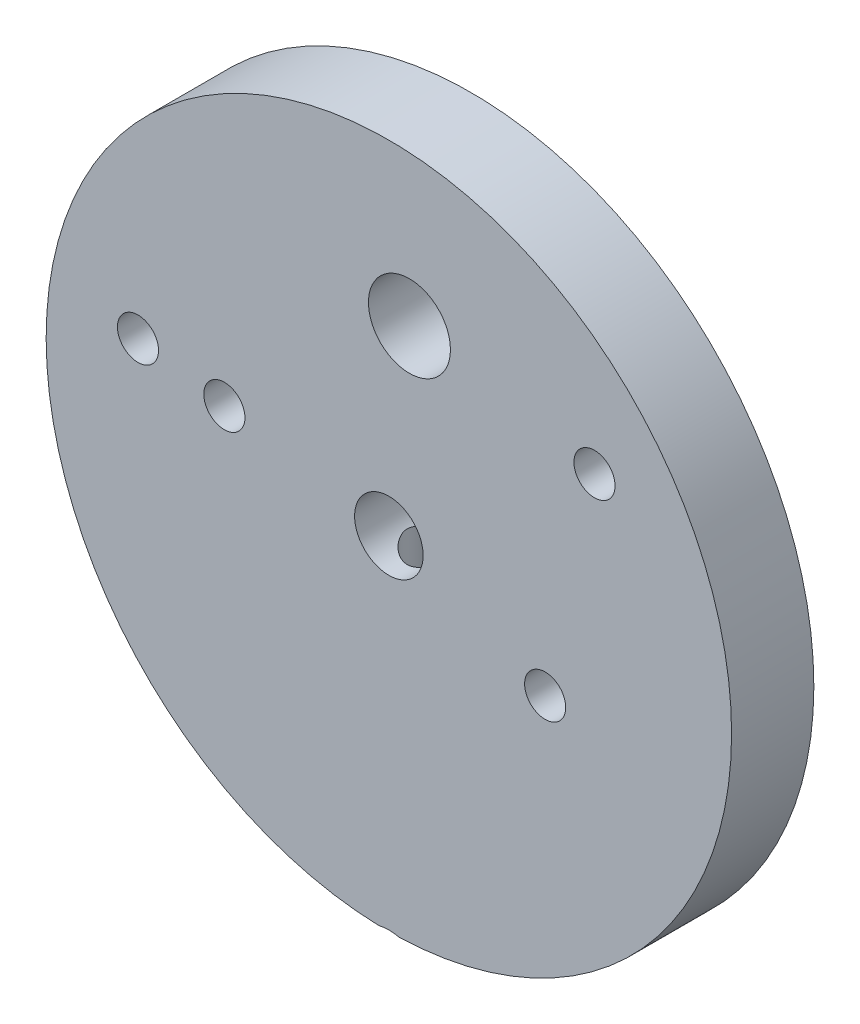
ISO-10303-21;
HEADER;
FILE_DESCRIPTION(('STEP AP214'),'2;1');
FILE_NAME('part.step','',(''),(''),'','','');
FILE_SCHEMA(('AUTOMOTIVE_DESIGN { 1 0 10303 214 1 1 1 1 }'));
ENDSEC;
DATA;
#1=APPLICATION_CONTEXT('core data for automotive mechanical design processes');
#2=APPLICATION_PROTOCOL_DEFINITION('international standard','automotive_design',2000,#1);
#3=PRODUCT_CONTEXT('',#1,'mechanical');
#4=PRODUCT('Part','Part','',(#3));
#5=PRODUCT_RELATED_PRODUCT_CATEGORY('part','',(#4));
#6=PRODUCT_DEFINITION_FORMATION('','',#4);
#7=PRODUCT_DEFINITION_CONTEXT('part definition',#1,'design');
#8=PRODUCT_DEFINITION('design','',#6,#7);
#9=PRODUCT_DEFINITION_SHAPE('','',#8);
#10=(LENGTH_UNIT() NAMED_UNIT(*) SI_UNIT(.MILLI.,.METRE.));
#11=(NAMED_UNIT(*) PLANE_ANGLE_UNIT() SI_UNIT($,.RADIAN.));
#12=(NAMED_UNIT(*) SI_UNIT($,.STERADIAN.) SOLID_ANGLE_UNIT());
#13=UNCERTAINTY_MEASURE_WITH_UNIT(LENGTH_MEASURE(1.E-05),#10,'distance_accuracy_value','');
#14=(GEOMETRIC_REPRESENTATION_CONTEXT(3) GLOBAL_UNCERTAINTY_ASSIGNED_CONTEXT((#13)) GLOBAL_UNIT_ASSIGNED_CONTEXT((#10,
#11,#12)) REPRESENTATION_CONTEXT('',''));
#15=CARTESIAN_POINT('',(0.,0.,0.));
#16=DIRECTION('',(0.,0.,1.));
#17=DIRECTION('',(1.,0.,0.));
#18=AXIS2_PLACEMENT_3D('',#15,#16,#17);
#19=CARTESIAN_POINT('',(0.,0.,3.));
#20=DIRECTION('',(0.,0.,1.));
#21=DIRECTION('',(1.,0.,0.));
#22=AXIS2_PLACEMENT_3D('',#19,#20,#21);
#23=PLANE('',#22);
#24=CARTESIAN_POINT('',(-2.83664534621359,-26.0287476091661,3.));
#25=CARTESIAN_POINT('',(-2.76531072517493,-25.979747647708,3.));
#26=CARTESIAN_POINT('',(-2.6935251877055,-25.9313937572425,3.));
#27=CARTESIAN_POINT('',(-2.54890587795035,-25.8362334592615,3.));
#28=CARTESIAN_POINT('',(-2.47607179603977,-25.7894275228763,3.));
#29=CARTESIAN_POINT('',(-2.32872818174244,-25.6973209891236,3.));
#30=CARTESIAN_POINT('',(-2.25421040362229,-25.6520335125885,3.));
#31=CARTESIAN_POINT('',(-2.10387584627041,-25.5636873397159,3.));
#32=CARTESIAN_POINT('',(-2.02805917154243,-25.5206284651849,3.));
#33=CARTESIAN_POINT('',(-1.79346473550118,-25.3926890623925,3.));
#34=CARTESIAN_POINT('',(-1.63229987426929,-25.312089953461,3.));
#35=CARTESIAN_POINT('',(-1.30302104487734,-25.1674390749372,3.));
#36=CARTESIAN_POINT('',(-1.13493074142441,-25.1033356270002,3.));
#37=CARTESIAN_POINT('',(-0.888434419115741,-25.0279764703033,3.));
#38=CARTESIAN_POINT('',(-0.8128906352692,-25.0073008818853,3.));
#39=CARTESIAN_POINT('',(-0.660576482159613,-24.9709760094303,3.));
#40=CARTESIAN_POINT('',(-0.583805949312308,-24.9553274017014,3.));
#41=CARTESIAN_POINT('',(-0.430179544278816,-24.929749902811,3.));
#42=CARTESIAN_POINT('',(-0.353333964597223,-24.9197597930517,3.));
#43=CARTESIAN_POINT('',(-0.199107895655327,-24.9056191999211,3.));
#44=CARTESIAN_POINT('',(-0.121727433519484,-24.9014684225826,3.));
#45=CARTESIAN_POINT('',(0.0484399656678558,-24.8989599826423,3.));
#46=CARTESIAN_POINT('',(0.141249236879402,-24.9019094067401,3.));
#47=CARTESIAN_POINT('',(0.326212401348018,-24.9162730746567,3.));
#48=CARTESIAN_POINT('',(0.418366158053664,-24.9276890328668,3.));
#49=CARTESIAN_POINT('',(0.602608166973431,-24.9585566782451,3.));
#50=CARTESIAN_POINT('',(0.694678002494478,-24.9781169747769,3.));
#51=CARTESIAN_POINT('',(0.876977203352027,-25.0243099762964,3.));
#52=CARTESIAN_POINT('',(0.967206813915699,-25.050941732227,3.));
#53=CARTESIAN_POINT('',(1.24673620285726,-25.1437740909094,3.));
#54=CARTESIAN_POINT('',(1.43252000344217,-25.2206319752431,3.));
#55=CARTESIAN_POINT('',(1.7047064715636,-25.3495840799246,3.));
#56=CARTESIAN_POINT('',(1.79451611571029,-25.3949436771718,3.));
#57=CARTESIAN_POINT('',(1.97215660266382,-25.4893928032348,3.));
#58=CARTESIAN_POINT('',(2.05998776589235,-25.5384817223611,3.));
#59=CARTESIAN_POINT('',(2.23039384174165,-25.6376531878738,3.));
#60=CARTESIAN_POINT('',(2.31303842428243,-25.6876173073952,3.));
#61=CARTESIAN_POINT('',(2.47689739966926,-25.7898487587656,3.));
#62=CARTESIAN_POINT('',(2.55811168003427,-25.8421162706346,3.));
#63=CARTESIAN_POINT('',(2.71865064586211,-25.9481415803404,3.));
#64=CARTESIAN_POINT('',(2.79798511486534,-26.0018846264753,3.));
#65=CARTESIAN_POINT('',(2.95553686167846,-26.1109377048038,3.));
#66=CARTESIAN_POINT('',(3.03375445763521,-26.166247276808,3.));
#67=CARTESIAN_POINT('',(3.11149968366827,-26.2222020176604,3.));
#68=B_SPLINE_CURVE_WITH_KNOTS('',3,(#24,#25,#26,#27,#28,#29,#30,#31,#32,#33,#34,#35,#36,#37,#38,
#39,#40,#41,#42,#43,#44,#45,#46,#47,#48,#49,#50,#51,#52,#53,#54,#55,#56,#57,#58,#59,#60,#61,#62,
#63,#64,#65,#66,#67),.UNSPECIFIED.,.F.,.F.,(4,2,2,2,2,2,2,2,2,2,2,2,2,2,2,2,2,2,2,2,2,4),(0.,
0.25963260985944,0.519343526732954,0.780907174044351,1.0424498749647,1.58244656220319,
2.12073034159699,2.35555508627146,2.59041141003198,2.82267578505833,3.05492846687895,
3.33308355702868,3.61129498627928,3.8933417824535,4.17535074437951,4.77670376445668,
5.07851488682883,5.38027677323758,5.66995963159193,5.95966517020511,6.24711760365554,
6.53448645222936),.UNSPECIFIED.);
#69=CARTESIAN_POINT('',(0.736747252931383,-24.9891417116574,3.));
#70=VERTEX_POINT('',#69);
#71=CARTESIAN_POINT('',(-0.736747252931388,-24.9891417116574,3.));
#72=VERTEX_POINT('',#71);
#73=EDGE_CURVE('E54',#70,#72,#68,.F.);
#74=ORIENTED_EDGE('',*,*,#73,.F.);
#75=CARTESIAN_POINT('',(0.,0.,3.));
#76=DIRECTION('',(0.,0.,1.));
#77=DIRECTION('',(1.,0.,0.));
#78=AXIS2_PLACEMENT_3D('',#75,#76,#77);
#79=CIRCLE('',#78,25.);
#80=EDGE_CURVE('E68',#70,#72,#79,.T.);
#81=ORIENTED_EDGE('',*,*,#80,.T.);
#82=EDGE_LOOP('',(#74,#81));
#83=FACE_BOUND('',#82,.T.);
#84=CARTESIAN_POINT('',(15.,11.4,3.));
#85=DIRECTION('',(0.,0.,1.));
#86=DIRECTION('',(1.,0.,0.));
#87=AXIS2_PLACEMENT_3D('',#84,#85,#86);
#88=CIRCLE('',#87,1.5);
#89=CARTESIAN_POINT('',(16.5,11.4,3.));
#90=VERTEX_POINT('',#89);
#91=EDGE_CURVE('E124',#90,#90,#88,.T.);
#92=ORIENTED_EDGE('',*,*,#91,.F.);
#93=EDGE_LOOP('',(#92));
#94=FACE_BOUND('',#93,.T.);
#95=CARTESIAN_POINT('',(1.5,14.,3.));
#96=DIRECTION('',(0.,0.,1.));
#97=DIRECTION('',(1.,0.,0.));
#98=AXIS2_PLACEMENT_3D('',#95,#96,#97);
#99=CIRCLE('',#98,2.99);
#100=CARTESIAN_POINT('',(4.49,14.,3.));
#101=VERTEX_POINT('',#100);
#102=EDGE_CURVE('E128',#101,#101,#99,.T.);
#103=ORIENTED_EDGE('',*,*,#102,.F.);
#104=EDGE_LOOP('',(#103));
#105=FACE_BOUND('',#104,.T.);
#106=CARTESIAN_POINT('',(-18.3,3.3,3.));
#107=DIRECTION('',(0.,0.,1.));
#108=DIRECTION('',(1.,0.,0.));
#109=AXIS2_PLACEMENT_3D('',#106,#107,#108);
#110=CIRCLE('',#109,1.5);
#111=CARTESIAN_POINT('',(-16.8,3.3,3.));
#112=VERTEX_POINT('',#111);
#113=EDGE_CURVE('E76',#112,#112,#110,.T.);
#114=ORIENTED_EDGE('',*,*,#113,.F.);
#115=EDGE_LOOP('',(#114));
#116=FACE_BOUND('',#115,.T.);
#117=CARTESIAN_POINT('',(-12.,2.2,3.));
#118=DIRECTION('',(0.,0.,1.));
#119=DIRECTION('',(1.,0.,0.));
#120=AXIS2_PLACEMENT_3D('',#117,#118,#119);
#121=CIRCLE('',#120,1.5);
#122=CARTESIAN_POINT('',(-10.5,2.2,3.));
#123=VERTEX_POINT('',#122);
#124=EDGE_CURVE('E134',#123,#123,#121,.T.);
#125=ORIENTED_EDGE('',*,*,#124,.F.);
#126=EDGE_LOOP('',(#125));
#127=FACE_BOUND('',#126,.T.);
#128=CARTESIAN_POINT('',(0.,0.,3.));
#129=DIRECTION('',(0.,0.,1.));
#130=DIRECTION('',(1.,0.,0.));
#131=AXIS2_PLACEMENT_3D('',#128,#129,#130);
#132=CIRCLE('',#131,2.5);
#133=CARTESIAN_POINT('',(2.5,0.,3.));
#134=VERTEX_POINT('',#133);
#135=EDGE_CURVE('E138',#134,#134,#132,.T.);
#136=ORIENTED_EDGE('',*,*,#135,.F.);
#137=EDGE_LOOP('',(#136));
#138=FACE_BOUND('',#137,.T.);
#139=CARTESIAN_POINT('',(11.4,-4.4,3.));
#140=DIRECTION('',(0.,0.,1.));
#141=DIRECTION('',(1.,0.,0.));
#142=AXIS2_PLACEMENT_3D('',#139,#140,#141);
#143=CIRCLE('',#142,1.5);
#144=CARTESIAN_POINT('',(12.9,-4.4,3.));
#145=VERTEX_POINT('',#144);
#146=EDGE_CURVE('E141',#145,#145,#143,.T.);
#147=ORIENTED_EDGE('',*,*,#146,.F.);
#148=EDGE_LOOP('',(#147));
#149=FACE_BOUND('',#148,.T.);
#150=ADVANCED_FACE('F33',(#83,#94,#105,#116,#127,#138,#149),#23,.T.);
#151=CARTESIAN_POINT('',(0.,0.,-3.));
#152=DIRECTION('',(0.,0.,1.));
#153=DIRECTION('',(1.,0.,0.));
#154=AXIS2_PLACEMENT_3D('',#151,#152,#153);
#155=PLANE('',#154);
#156=CARTESIAN_POINT('',(15.,11.4,-3.));
#157=DIRECTION('',(0.,0.,1.));
#158=DIRECTION('',(1.,0.,0.));
#159=AXIS2_PLACEMENT_3D('',#156,#157,#158);
#160=CIRCLE('',#159,1.5);
#161=CARTESIAN_POINT('',(16.5,11.4,-3.));
#162=VERTEX_POINT('',#161);
#163=EDGE_CURVE('E143',#162,#162,#160,.T.);
#164=ORIENTED_EDGE('',*,*,#163,.T.);
#165=EDGE_LOOP('',(#164));
#166=FACE_BOUND('',#165,.T.);
#167=CARTESIAN_POINT('',(1.5,14.,-3.));
#168=DIRECTION('',(0.,0.,1.));
#169=DIRECTION('',(1.,0.,0.));
#170=AXIS2_PLACEMENT_3D('',#167,#168,#169);
#171=CIRCLE('',#170,2.99);
#172=CARTESIAN_POINT('',(4.49,14.,-3.));
#173=VERTEX_POINT('',#172);
#174=EDGE_CURVE('E155',#173,#173,#171,.T.);
#175=ORIENTED_EDGE('',*,*,#174,.T.);
#176=EDGE_LOOP('',(#175));
#177=FACE_BOUND('',#176,.T.);
#178=CARTESIAN_POINT('',(-18.3,3.3,-3.));
#179=DIRECTION('',(0.,0.,1.));
#180=DIRECTION('',(1.,0.,0.));
#181=AXIS2_PLACEMENT_3D('',#178,#179,#180);
#182=CIRCLE('',#181,1.5);
#183=CARTESIAN_POINT('',(-16.8,3.3,-3.));
#184=VERTEX_POINT('',#183);
#185=EDGE_CURVE('E80',#184,#184,#182,.T.);
#186=ORIENTED_EDGE('',*,*,#185,.T.);
#187=EDGE_LOOP('',(#186));
#188=FACE_BOUND('',#187,.T.);
#189=CARTESIAN_POINT('',(0.,0.,-3.));
#190=DIRECTION('',(0.,0.,1.));
#191=DIRECTION('',(1.,0.,0.));
#192=AXIS2_PLACEMENT_3D('',#189,#190,#191);
#193=CIRCLE('',#192,25.);
#194=CARTESIAN_POINT('',(0.736747252931383,-24.9891417116574,-3.));
#195=VERTEX_POINT('',#194);
#196=CARTESIAN_POINT('',(-0.736747252931388,-24.9891417116574,-3.));
#197=VERTEX_POINT('',#196);
#198=EDGE_CURVE('E73',#195,#197,#193,.T.);
#199=ORIENTED_EDGE('',*,*,#198,.F.);
#200=CARTESIAN_POINT('',(-2.83664534621359,-26.0287476091661,-3.));
#201=CARTESIAN_POINT('',(-2.76531072517493,-25.979747647708,-3.));
#202=CARTESIAN_POINT('',(-2.6935251877055,-25.9313937572425,-3.));
#203=CARTESIAN_POINT('',(-2.54890587795035,-25.8362334592615,-3.));
#204=CARTESIAN_POINT('',(-2.47607179603977,-25.7894275228763,-3.));
#205=CARTESIAN_POINT('',(-2.32872818174244,-25.6973209891236,-3.));
#206=CARTESIAN_POINT('',(-2.25421040362229,-25.6520335125885,-3.));
#207=CARTESIAN_POINT('',(-2.10387584627041,-25.5636873397159,-3.));
#208=CARTESIAN_POINT('',(-2.02805917154243,-25.5206284651849,-3.));
#209=CARTESIAN_POINT('',(-1.79346473550118,-25.3926890623925,-3.));
#210=CARTESIAN_POINT('',(-1.63229987426929,-25.312089953461,-3.));
#211=CARTESIAN_POINT('',(-1.30302104487734,-25.1674390749372,-3.));
#212=CARTESIAN_POINT('',(-1.13493074142441,-25.1033356270002,-3.));
#213=CARTESIAN_POINT('',(-0.888434419115741,-25.0279764703033,-3.));
#214=CARTESIAN_POINT('',(-0.8128906352692,-25.0073008818853,-3.));
#215=CARTESIAN_POINT('',(-0.660576482159613,-24.9709760094303,-3.));
#216=CARTESIAN_POINT('',(-0.583805949312308,-24.9553274017014,-3.));
#217=CARTESIAN_POINT('',(-0.430179544278816,-24.929749902811,-3.));
#218=CARTESIAN_POINT('',(-0.353333964597223,-24.9197597930517,-3.));
#219=CARTESIAN_POINT('',(-0.199107895655327,-24.9056191999211,-3.));
#220=CARTESIAN_POINT('',(-0.121727433519484,-24.9014684225826,-3.));
#221=CARTESIAN_POINT('',(0.0484399656678558,-24.8989599826423,-3.));
#222=CARTESIAN_POINT('',(0.141249236879402,-24.9019094067401,-3.));
#223=CARTESIAN_POINT('',(0.326212401348018,-24.9162730746567,-3.));
#224=CARTESIAN_POINT('',(0.418366158053664,-24.9276890328668,-3.));
#225=CARTESIAN_POINT('',(0.602608166973431,-24.9585566782451,-3.));
#226=CARTESIAN_POINT('',(0.694678002494478,-24.9781169747769,-3.));
#227=CARTESIAN_POINT('',(0.876977203352027,-25.0243099762964,-3.));
#228=CARTESIAN_POINT('',(0.967206813915699,-25.050941732227,-3.));
#229=CARTESIAN_POINT('',(1.24673620285726,-25.1437740909094,-3.));
#230=CARTESIAN_POINT('',(1.43252000344217,-25.2206319752431,-3.));
#231=CARTESIAN_POINT('',(1.7047064715636,-25.3495840799246,-3.));
#232=CARTESIAN_POINT('',(1.79451611571029,-25.3949436771718,-3.));
#233=CARTESIAN_POINT('',(1.97215660266382,-25.4893928032348,-3.));
#234=CARTESIAN_POINT('',(2.05998776589235,-25.5384817223611,-3.));
#235=CARTESIAN_POINT('',(2.23039384174165,-25.6376531878738,-3.));
#236=CARTESIAN_POINT('',(2.31303842428243,-25.6876173073952,-3.));
#237=CARTESIAN_POINT('',(2.47689739966926,-25.7898487587656,-3.));
#238=CARTESIAN_POINT('',(2.55811168003427,-25.8421162706346,-3.));
#239=CARTESIAN_POINT('',(2.71865064586211,-25.9481415803404,-3.));
#240=CARTESIAN_POINT('',(2.79798511486534,-26.0018846264753,-3.));
#241=CARTESIAN_POINT('',(2.95553686167846,-26.1109377048038,-3.));
#242=CARTESIAN_POINT('',(3.03375445763521,-26.166247276808,-3.));
#243=CARTESIAN_POINT('',(3.11149968366827,-26.2222020176604,-3.));
#244=B_SPLINE_CURVE_WITH_KNOTS('',3,(#200,#201,#202,#203,#204,#205,#206,#207,#208,#209,#210,
#211,#212,#213,#214,#215,#216,#217,#218,#219,#220,#221,#222,#223,#224,#225,#226,#227,#228,#229,
#230,#231,#232,#233,#234,#235,#236,#237,#238,#239,#240,#241,#242,#243),.UNSPECIFIED.,.F.,.F.,(4,
2,2,2,2,2,2,2,2,2,2,2,2,2,2,2,2,2,2,2,2,4),(0.,0.25963260985944,0.519343526732954,
0.780907174044351,1.0424498749647,1.58244656220319,2.12073034159699,2.35555508627146,
2.59041141003198,2.82267578505833,3.05492846687895,3.33308355702868,3.61129498627928,
3.8933417824535,4.17535074437951,4.77670376445668,5.07851488682883,5.38027677323758,
5.66995963159193,5.95966517020511,6.24711760365554,6.53448645222936),.UNSPECIFIED.);
#245=EDGE_CURVE('E63',#195,#197,#244,.F.);
#246=ORIENTED_EDGE('',*,*,#245,.T.);
#247=EDGE_LOOP('',(#199,#246));
#248=FACE_BOUND('',#247,.T.);
#249=CARTESIAN_POINT('',(-12.,2.2,-3.));
#250=DIRECTION('',(0.,0.,1.));
#251=DIRECTION('',(1.,0.,0.));
#252=AXIS2_PLACEMENT_3D('',#249,#250,#251);
#253=CIRCLE('',#252,1.5);
#254=CARTESIAN_POINT('',(-10.5,2.2,-3.));
#255=VERTEX_POINT('',#254);
#256=EDGE_CURVE('E159',#255,#255,#253,.T.);
#257=ORIENTED_EDGE('',*,*,#256,.T.);
#258=EDGE_LOOP('',(#257));
#259=FACE_BOUND('',#258,.T.);
#260=CARTESIAN_POINT('',(0.,0.,-3.));
#261=DIRECTION('',(0.,0.,1.));
#262=DIRECTION('',(1.,0.,0.));
#263=AXIS2_PLACEMENT_3D('',#260,#261,#262);
#264=CIRCLE('',#263,2.5);
#265=CARTESIAN_POINT('',(2.5,0.,-3.));
#266=VERTEX_POINT('',#265);
#267=EDGE_CURVE('E151',#266,#266,#264,.T.);
#268=ORIENTED_EDGE('',*,*,#267,.T.);
#269=EDGE_LOOP('',(#268));
#270=FACE_BOUND('',#269,.T.);
#271=CARTESIAN_POINT('',(11.4,-4.4,-3.));
#272=DIRECTION('',(0.,0.,1.));
#273=DIRECTION('',(1.,0.,0.));
#274=AXIS2_PLACEMENT_3D('',#271,#272,#273);
#275=CIRCLE('',#274,1.5);
#276=CARTESIAN_POINT('',(12.9,-4.4,-3.));
#277=VERTEX_POINT('',#276);
#278=EDGE_CURVE('E144',#277,#277,#275,.T.);
#279=ORIENTED_EDGE('',*,*,#278,.T.);
#280=EDGE_LOOP('',(#279));
#281=FACE_BOUND('',#280,.T.);
#282=ADVANCED_FACE('F71',(#166,#177,#188,#248,#259,#270,#281),#155,.F.);
#283=CARTESIAN_POINT('',(0.,0.,3.));
#284=DIRECTION('',(0.,0.,-1.));
#285=DIRECTION('',(-1.,0.,0.));
#286=AXIS2_PLACEMENT_3D('',#283,#284,#285);
#287=CYLINDRICAL_SURFACE('',#286,25.);
#288=ORIENTED_EDGE('',*,*,#80,.F.);
#289=CARTESIAN_POINT('',(-2.16758617526592,-24.9058542015405,-2.08248147327669));
#290=CARTESIAN_POINT('',(-2.26419811052355,-24.8974462926179,-1.96978116987875));
#291=CARTESIAN_POINT('',(-2.35260218398907,-24.8891869614,-1.84999180535656));
#292=CARTESIAN_POINT('',(-2.51156332573361,-24.8736495124773,-1.59896640921571));
#293=CARTESIAN_POINT('',(-2.58210449157263,-24.8663722717505,-1.46772031703202));
#294=CARTESIAN_POINT('',(-2.71517230924507,-24.8522257870707,-1.17223414555063));
#295=CARTESIAN_POINT('',(-2.77399499209722,-24.8456635744722,-1.00629725947052));
#296=CARTESIAN_POINT('',(-2.86404719683586,-24.8354443067285,-0.666995962810196));
#297=CARTESIAN_POINT('',(-2.89526614218037,-24.8317883651931,-0.493628731899825));
#298=CARTESIAN_POINT('',(-2.93002341139618,-24.8277122664524,-0.138651220259233));
#299=CARTESIAN_POINT('',(-2.93267335411916,-24.8273959647119,0.0430479653611176));
#300=CARTESIAN_POINT('',(-2.90791833368191,-24.8303072519908,0.404362039114832));
#301=CARTESIAN_POINT('',(-2.8805120221463,-24.8335350000024,0.583976833373478));
#302=CARTESIAN_POINT('',(-2.7958518599429,-24.8432089858783,0.937540554156183));
#303=CARTESIAN_POINT('',(-2.73835224328342,-24.8496817061741,1.11143010401536));
#304=CARTESIAN_POINT('',(-2.59457976452862,-24.8651031794325,1.4467951485922));
#305=CARTESIAN_POINT('',(-2.50830701700608,-24.8740519225356,1.60827069273851));
#306=CARTESIAN_POINT('',(-2.31069844256378,-24.8931781658867,1.91096664400554));
#307=CARTESIAN_POINT('',(-2.19983127898705,-24.9033312224825,2.05249395272713));
#308=CARTESIAN_POINT('',(-1.95485284030474,-24.923755787641,2.31378337542357));
#309=CARTESIAN_POINT('',(-1.82074744697173,-24.9340272656177,2.43355098126902));
#310=CARTESIAN_POINT('',(-1.53944942100541,-24.9529361893474,2.64190624245401));
#311=CARTESIAN_POINT('',(-1.39312677911095,-24.9616266328222,2.73166213898459));
#312=CARTESIAN_POINT('',(-1.08670067369469,-24.9768400625505,2.88360537014624));
#313=CARTESIAN_POINT('',(-0.926603145070919,-24.9833639764217,2.94580450725641));
#314=CARTESIAN_POINT('',(-0.607396035639093,-24.9930998896091,3.03714233586883));
#315=CARTESIAN_POINT('',(-0.448788092323808,-24.9964849545025,3.06801884612167));
#316=CARTESIAN_POINT('',(-0.128596195267381,-25.0001812083907,3.10168932590994));
#317=CARTESIAN_POINT('',(0.0329869452802382,-25.000493225187,3.10449085813789));
#318=CARTESIAN_POINT('',(0.347976941281974,-24.9980557707246,3.08234298584731));
#319=CARTESIAN_POINT('',(0.501460370767483,-24.9954227722125,3.05844939054164));
#320=CARTESIAN_POINT('',(0.802252464567269,-24.9875776664031,2.98554161433037));
#321=CARTESIAN_POINT('',(0.949561123865766,-24.9823655570108,2.93652741301969));
#322=CARTESIAN_POINT('',(1.235177902944,-24.9698808079691,2.814737846973));
#323=CARTESIAN_POINT('',(1.37341082598936,-24.9625931125497,2.74178825045375));
#324=CARTESIAN_POINT('',(1.63633532116577,-24.9467389622145,2.57473002126735));
#325=CARTESIAN_POINT('',(1.76102437011938,-24.9381722697293,2.48061745600362));
#326=CARTESIAN_POINT('',(1.99950607302834,-24.9202115945503,2.26938001838269));
#327=CARTESIAN_POINT('',(2.11253756988607,-24.9107976907587,2.1513982424247));
#328=CARTESIAN_POINT('',(2.31846111934454,-24.8924778103421,1.8989804270771));
#329=CARTESIAN_POINT('',(2.41134797613937,-24.8835719651935,1.7645401565861));
#330=CARTESIAN_POINT('',(2.57984127227692,-24.8666848647037,1.47485322999587));
#331=CARTESIAN_POINT('',(2.65417276206845,-24.8587844235291,1.31885975889111));
#332=CARTESIAN_POINT('',(2.77688937706012,-24.8453760065678,0.996885138901806));
#333=CARTESIAN_POINT('',(2.82526886317361,-24.8398685508,0.830901828041465));
#334=CARTESIAN_POINT('',(2.8966095271968,-24.8316535899424,0.486265643165659));
#335=CARTESIAN_POINT('',(2.9184304015994,-24.8290720028536,0.307372927706819));
#336=CARTESIAN_POINT('',(2.93247105177914,-24.8274175247801,-0.0515961252130576));
#337=CARTESIAN_POINT('',(2.92468699609087,-24.8283450879491,-0.231672612866914));
#338=CARTESIAN_POINT('',(2.87929354920295,-24.8336505421533,-0.591012729747056));
#339=CARTESIAN_POINT('',(2.84119476015418,-24.8380850415636,-0.770214058213243));
#340=CARTESIAN_POINT('',(2.73535155764383,-24.8499631308845,-1.11955906219915));
#341=CARTESIAN_POINT('',(2.66760622732317,-24.8574068138575,-1.28970245740758));
#342=CARTESIAN_POINT('',(2.50466778336005,-24.8743494650221,-1.61431487761464));
#343=CARTESIAN_POINT('',(2.40972423404199,-24.8838295582078,-1.76890988902777));
#344=CARTESIAN_POINT('',(2.19431530567908,-24.903747405814,-2.0591311009763));
#345=CARTESIAN_POINT('',(2.0738540432621,-24.9141850056116,-2.19476035529772));
#346=CARTESIAN_POINT('',(1.81529310574532,-24.9343311264593,-2.43763912178974));
#347=CARTESIAN_POINT('',(1.6780015111583,-24.9440523484622,-2.54574645030949));
#348=CARTESIAN_POINT('',(1.38622796118539,-24.9619643010225,-2.73572465981523));
#349=CARTESIAN_POINT('',(1.23175294320882,-24.9701556456799,-2.81760607748252));
#350=CARTESIAN_POINT('',(0.919601670453763,-24.983540522943,-2.94778632494971));
#351=CARTESIAN_POINT('',(0.762627358327021,-24.9888800443824,-2.99775363130508));
#352=CARTESIAN_POINT('',(0.442271726680717,-24.9966000297288,-3.06923754714054));
#353=CARTESIAN_POINT('',(0.278892813926782,-24.9989815944074,-3.09076474049114));
#354=CARTESIAN_POINT('',(-0.0410283352265158,-25.0004532260287,-3.10411022796195));
#355=CARTESIAN_POINT('',(-0.197512920330296,-24.999698983349,-3.097333700603));
#356=CARTESIAN_POINT('',(-0.507066084721128,-24.9953364544472,-3.05750443704279));
#357=CARTESIAN_POINT('',(-0.660134509100236,-24.9917280390702,-3.02445051175532));
#358=CARTESIAN_POINT('',(-0.95733703275022,-24.9821029795024,-2.93373516711902));
#359=CARTESIAN_POINT('',(-1.10153255769605,-24.9761057361452,-2.87627174526619));
#360=CARTESIAN_POINT('',(-1.37859271091778,-24.9623461688007,-2.73884806260258));
#361=CARTESIAN_POINT('',(-1.51146246663922,-24.9545846494416,-2.65889805325247));
#362=CARTESIAN_POINT('',(-1.73500302855206,-24.939916220667,-2.49906224691524));
#363=CARTESIAN_POINT('',(-1.82850796602357,-24.9331998879828,-2.42307209714361));
#364=CARTESIAN_POINT('',(-2.00566458170176,-24.9195745672006,-2.26043081002573));
#365=CARTESIAN_POINT('',(-2.08931877499408,-24.9126656288382,-2.17378240554021));
#366=CARTESIAN_POINT('',(-2.16758617526592,-24.9058542015405,-2.08248147327669));
#367=B_SPLINE_CURVE_WITH_KNOTS('',3,(#289,#290,#291,#292,#293,#294,#295,#296,#297,#298,#299,
#300,#301,#302,#303,#304,#305,#306,#307,#308,#309,#310,#311,#312,#313,#314,#315,#316,#317,#318,
#319,#320,#321,#322,#323,#324,#325,#326,#327,#328,#329,#330,#331,#332,#333,#334,#335,#336,#337,
#338,#339,#340,#341,#342,#343,#344,#345,#346,#347,#348,#349,#350,#351,#352,#353,#354,#355,#356,
#357,#358,#359,#360,#361,#362,#363,#364,#365,#366),.UNSPECIFIED.,.T.,.F.,(4,2,2,2,2,2,2,2,2,2,2,
2,2,2,2,2,2,2,2,2,2,2,2,2,2,2,2,2,2,2,2,2,2,2,2,2,2,2,4),(0.,0.445715829158682,
0.891827072447249,1.41791500766711,1.94420442947785,2.48681380746776,3.02944752884583,
3.5765836228078,4.12371753813439,4.66120575069208,5.19855811908104,5.71152708301774,
6.2242761309593,6.70669784993856,7.18898961315385,7.65286113182454,8.11673302729186,
8.58405938924099,9.05147266371235,9.54030497235087,10.0292632134995,10.545884339747,
11.062617676692,11.6008326986407,12.1391173786636,12.6862728153536,13.2334451747558,
13.7757493625761,14.317966130075,14.8403142092439,15.3624521626598,15.8543898487369,
16.3461444106194,16.8137828777068,17.2814425072438,17.7453790545593,18.2091044386824,
18.5702808049504,18.9313647550362),.UNSPECIFIED.);
#368=EDGE_CURVE('E11',#70,#195,#367,.T.);
#369=ORIENTED_EDGE('',*,*,#368,.T.);
#370=ORIENTED_EDGE('',*,*,#198,.T.);
#371=EDGE_CURVE('E47',#197,#72,#367,.T.);
#372=ORIENTED_EDGE('',*,*,#371,.T.);
#373=EDGE_LOOP('',(#288,#369,#370,#372));
#374=FACE_BOUND('',#373,.T.);
#375=ADVANCED_FACE('F35',(#374),#287,.T.);
#376=CARTESIAN_POINT('',(-18.3,3.3,3.));
#377=DIRECTION('',(0.,0.,-1.));
#378=DIRECTION('',(-1.,0.,0.));
#379=AXIS2_PLACEMENT_3D('',#376,#377,#378);
#380=CYLINDRICAL_SURFACE('',#379,1.5);
#381=ORIENTED_EDGE('',*,*,#113,.T.);
#382=EDGE_LOOP('',(#381));
#383=FACE_BOUND('',#382,.T.);
#384=ORIENTED_EDGE('',*,*,#185,.F.);
#385=EDGE_LOOP('',(#384));
#386=FACE_BOUND('',#385,.T.);
#387=ADVANCED_FACE('F113',(#383,#386),#380,.F.);
#388=CARTESIAN_POINT('',(-12.,2.2,3.));
#389=DIRECTION('',(0.,0.,-1.));
#390=DIRECTION('',(-1.,0.,0.));
#391=AXIS2_PLACEMENT_3D('',#388,#389,#390);
#392=CYLINDRICAL_SURFACE('',#391,1.5);
#393=ORIENTED_EDGE('',*,*,#124,.T.);
#394=EDGE_LOOP('',(#393));
#395=FACE_BOUND('',#394,.T.);
#396=ORIENTED_EDGE('',*,*,#256,.F.);
#397=EDGE_LOOP('',(#396));
#398=FACE_BOUND('',#397,.T.);
#399=ADVANCED_FACE('F167',(#395,#398),#392,.F.);
#400=CARTESIAN_POINT('',(1.5,14.,3.));
#401=DIRECTION('',(0.,0.,-1.));
#402=DIRECTION('',(-1.,0.,0.));
#403=AXIS2_PLACEMENT_3D('',#400,#401,#402);
#404=CYLINDRICAL_SURFACE('',#403,2.99);
#405=ORIENTED_EDGE('',*,*,#102,.T.);
#406=EDGE_LOOP('',(#405));
#407=FACE_BOUND('',#406,.T.);
#408=ORIENTED_EDGE('',*,*,#174,.F.);
#409=EDGE_LOOP('',(#408));
#410=FACE_BOUND('',#409,.T.);
#411=ADVANCED_FACE('F173',(#407,#410),#404,.F.);
#412=CARTESIAN_POINT('',(0.,0.,3.));
#413=DIRECTION('',(0.,0.,-1.));
#414=DIRECTION('',(-1.,0.,0.));
#415=AXIS2_PLACEMENT_3D('',#412,#413,#414);
#416=CYLINDRICAL_SURFACE('',#415,2.5);
#417=CARTESIAN_POINT('',(0.,-2.5,-1.65));
#418=CARTESIAN_POINT('',(-0.0830573983732392,-2.49999873549003,-1.64999873137196));
#419=CARTESIAN_POINT('',(-0.166127065031046,-2.49582409665183,-1.64369332813587));
#420=CARTESIAN_POINT('',(-0.329627564785519,-2.47953793670965,-1.61885588365078));
#421=CARTESIAN_POINT('',(-0.410056740989749,-2.46742152850525,-1.60031631385543));
#422=CARTESIAN_POINT('',(-0.565666795275703,-2.43645078323809,-1.55213728113011));
#423=CARTESIAN_POINT('',(-0.640870379585382,-2.41762810153113,-1.52254993559189));
#424=CARTESIAN_POINT('',(-0.784950958130406,-2.37476519567406,-1.45352693083464));
#425=CARTESIAN_POINT('',(-0.853827124859529,-2.3507242904579,-1.4140899859757));
#426=CARTESIAN_POINT('',(-0.989836866046781,-2.29695661149613,-1.32286952215449));
#427=CARTESIAN_POINT('',(-1.05633669830188,-2.26692168776846,-1.27032656825891));
#428=CARTESIAN_POINT('',(-1.18018285126921,-2.20498845637974,-1.15618952097825));
#429=CARTESIAN_POINT('',(-1.23751597614873,-2.17308755114355,-1.09458262017789));
#430=CARTESIAN_POINT('',(-1.350431491955,-2.10506784648215,-0.953025393794767));
#431=CARTESIAN_POINT('',(-1.40438210241811,-2.06905676275693,-0.871711330887167));
#432=CARTESIAN_POINT('',(-1.49776993203111,-2.00249251833605,-0.69912083324243));
#433=CARTESIAN_POINT('',(-1.53723225426474,-1.97192996499629,-0.607861988604589));
#434=CARTESIAN_POINT('',(-1.59072490572626,-1.92884004929685,-0.444135605276352));
#435=CARTESIAN_POINT('',(-1.608795235838,-1.91365570400325,-0.373693969164825));
#436=CARTESIAN_POINT('',(-1.63553399265365,-1.89085843424037,-0.2299018511051));
#437=CARTESIAN_POINT('',(-1.64421813584104,-1.88323285495121,-0.156556445501191));
#438=CARTESIAN_POINT('',(-1.65164261236611,-1.87672751277291,-0.00867667417277746));
#439=CARTESIAN_POINT('',(-1.6503449865543,-1.87788113567674,0.065861153473412));
#440=CARTESIAN_POINT('',(-1.63781110929921,-1.8888189423104,0.213476461715619));
#441=CARTESIAN_POINT('',(-1.62656646304847,-1.89861041595223,0.286552655480399));
#442=CARTESIAN_POINT('',(-1.5955062485521,-1.92477146257471,0.426367588716838));
#443=CARTESIAN_POINT('',(-1.57605424200619,-1.94086012047488,0.49324304013499));
#444=CARTESIAN_POINT('',(-1.52947910263703,-1.97777008130563,0.622849541099383));
#445=CARTESIAN_POINT('',(-1.50235345168169,-1.9985929373381,0.685579221847336));
#446=CARTESIAN_POINT('',(-1.4349555942054,-2.04767344699339,0.818549093219997));
#447=CARTESIAN_POINT('',(-1.39313654723765,-2.07658411071837,0.887762289651974));
#448=CARTESIAN_POINT('',(-1.30024206663366,-2.13598181471749,1.0189919318167));
#449=CARTESIAN_POINT('',(-1.24915529331516,-2.16647075308914,1.08099940667233));
#450=CARTESIAN_POINT('',(-1.12681675112711,-2.23295257125343,1.20920418248633));
#451=CARTESIAN_POINT('',(-1.05357972912127,-2.26877919105011,1.27361436846183));
#452=CARTESIAN_POINT('',(-0.8954851438868,-2.33569104521111,1.38930624083507));
#453=CARTESIAN_POINT('',(-0.810639038986188,-2.36678089167,1.44060073114898));
#454=CARTESIAN_POINT('',(-0.648739426272081,-2.41553581634305,1.51923062986409));
#455=CARTESIAN_POINT('',(-0.573446407588017,-2.43463913774794,1.54929570380841));
#456=CARTESIAN_POINT('',(-0.417976051373882,-2.4660834146067,1.59825596853883));
#457=CARTESIAN_POINT('',(-0.33780286329529,-2.47843002823382,1.61716050638165));
#458=CARTESIAN_POINT('',(-0.174366759571419,-2.49526903279627,1.64285212544903));
#459=CARTESIAN_POINT('',(-0.0910926735099016,-2.49972950264785,1.64958996132531));
#460=CARTESIAN_POINT('',(0.0755454771473694,-2.50024632578377,1.65037341496494));
#461=CARTESIAN_POINT('',(0.158909538677221,-2.49630295692062,1.64441945235176));
#462=CARTESIAN_POINT('',(0.317590995066729,-2.48094276300905,1.62100177024052));
#463=CARTESIAN_POINT('',(0.393076905917277,-2.4700348147583,1.60432124818647));
#464=CARTESIAN_POINT('',(0.539940099102308,-2.44214181786327,1.56103485655246));
#465=CARTESIAN_POINT('',(0.611316719406964,-2.42515579316953,1.53442739282274));
#466=CARTESIAN_POINT('',(0.753061900566429,-2.38509288962557,1.47031801304004));
#467=CARTESIAN_POINT('',(0.823069989043658,-2.36169438729977,1.43222519006879));
#468=CARTESIAN_POINT('',(0.955962444034783,-2.31110387644411,1.34717107768241));
#469=CARTESIAN_POINT('',(1.01884206641326,-2.28390936814435,1.30020393702918));
#470=CARTESIAN_POINT('',(1.14612838724312,-2.22308599354602,1.19038919580252));
#471=CARTESIAN_POINT('',(1.20922126106421,-2.18911767364703,1.12620583079495));
#472=CARTESIAN_POINT('',(1.32429793175259,-2.12148327059167,0.988334427798432));
#473=CARTESIAN_POINT('',(1.37627528682548,-2.08781737346631,0.914640917829759));
#474=CARTESIAN_POINT('',(1.46353640050704,-2.0274590554466,0.766296600582146));
#475=CARTESIAN_POINT('',(1.49996651133877,-2.00040607756764,0.692470451905224));
#476=CARTESIAN_POINT('',(1.56184713022858,-1.95247859125419,0.538503680951202));
#477=CARTESIAN_POINT('',(1.58731746510718,-1.93159294745003,0.458374774082886));
#478=CARTESIAN_POINT('',(1.6226819945088,-1.90193273164488,0.307201438130989));
#479=CARTESIAN_POINT('',(1.63447382745328,-1.89171317806773,0.236891667561832));
#480=CARTESIAN_POINT('',(1.64882828119084,-1.87921870273532,0.0946611706312379));
#481=CARTESIAN_POINT('',(1.65139975183536,-1.8769361629707,0.0227420557128786));
#482=CARTESIAN_POINT('',(1.64714925615308,-1.88066605675987,-0.120591133637519));
#483=CARTESIAN_POINT('',(1.64032696287034,-1.88667877903555,-0.192005190403728));
#484=CARTESIAN_POINT('',(1.61773943894529,-1.90607790977934,-0.332402434524805));
#485=CARTESIAN_POINT('',(1.60196240572203,-1.91947404910829,-0.401382285826582));
#486=CARTESIAN_POINT('',(1.55672361400764,-1.95644518519264,-0.554170797651737));
#487=CARTESIAN_POINT('',(1.52467713481425,-1.98181441881501,-0.636772363273417));
#488=CARTESIAN_POINT('',(1.44883296418163,-2.03791662644481,-0.794394209676626));
#489=CARTESIAN_POINT('',(1.40501894611546,-2.06865703170771,-0.86940375646762));
#490=CARTESIAN_POINT('',(1.30588975445997,-2.13264932094016,-1.01234437962015));
#491=CARTESIAN_POINT('',(1.25038987560408,-2.1659352858846,-1.08013166298805));
#492=CARTESIAN_POINT('',(1.1291028716024,-2.23156562575566,-1.20635347060613));
#493=CARTESIAN_POINT('',(1.06331279816866,-2.26390972766489,-1.2647853046465));
#494=CARTESIAN_POINT('',(0.913224109526746,-2.328844852877,-1.37783171013876));
#495=CARTESIAN_POINT('',(0.827637911480485,-2.36095353516902,-1.43103774089958));
#496=CARTESIAN_POINT('',(0.646049497163131,-2.41693780003556,-1.52162979943429));
#497=CARTESIAN_POINT('',(0.550067122404143,-2.44082871479072,-1.55904531806631));
#498=CARTESIAN_POINT('',(0.3780291357627,-2.47235569176035,-1.60788092445762));
#499=CARTESIAN_POINT('',(0.303664744230145,-2.48264654834952,-1.62360538601067));
#500=CARTESIAN_POINT('',(0.152869610757762,-2.49646746879981,-1.64466271697479));
#501=CARTESIAN_POINT('',(0.0764400010130794,-2.50000116376319,-1.65000116755317));
#502=CARTESIAN_POINT('',(0.,-2.5,-1.65));
#503=B_SPLINE_CURVE_WITH_KNOTS('',3,(#417,#418,#419,#420,#421,#422,#423,#424,#425,#426,#427,
#428,#429,#430,#431,#432,#433,#434,#435,#436,#437,#438,#439,#440,#441,#442,#443,#444,#445,#446,
#447,#448,#449,#450,#451,#452,#453,#454,#455,#456,#457,#458,#459,#460,#461,#462,#463,#464,#465,
#466,#467,#468,#469,#470,#471,#472,#473,#474,#475,#476,#477,#478,#479,#480,#481,#482,#483,#484,
#485,#486,#487,#488,#489,#490,#491,#492,#493,#494,#495,#496,#497,#498,#499,#500,#501,#502),
.UNSPECIFIED.,.T.,.F.,(4,2,2,2,2,2,2,2,2,2,2,2,2,2,2,2,2,2,2,2,2,2,2,2,2,2,2,2,2,2,2,2,2,2,2,2,
2,2,2,2,2,2,4),(0.,0.248863173219164,0.497879632505738,0.745735911637783,0.993624559661681,
1.26236142699035,1.53148173454875,1.84208059721148,2.15213873331274,2.37412103166173,
2.59573105830194,2.81818424963007,3.0408253600701,3.25449658913793,3.46823801663209,
3.72496879793679,3.98201585159,4.29224112966059,4.60216239062961,4.8509948640788,
5.09961864119514,5.34924649914315,5.59886610388089,5.83205917661708,6.06528971354039,
6.31352952087294,6.5619335787085,6.84938688817397,7.13700633715916,7.39601090345959,
7.65454492637288,7.86965548867984,8.08455952907284,8.29947104952726,8.51466648895039,
8.78967221613734,9.06506148314461,9.34518323893304,9.62538540113005,9.94089155188798,
10.2558058174588,10.484964597082,10.7140001987933),.UNSPECIFIED.);
#504=CARTESIAN_POINT('',(0.,-2.5,-1.65));
#505=VERTEX_POINT('',#504);
#506=EDGE_CURVE('E38',#505,#505,#503,.T.);
#507=ORIENTED_EDGE('',*,*,#506,.F.);
#508=EDGE_LOOP('',(#507));
#509=FACE_BOUND('',#508,.T.);
#510=ORIENTED_EDGE('',*,*,#135,.T.);
#511=EDGE_LOOP('',(#510));
#512=FACE_BOUND('',#511,.T.);
#513=ORIENTED_EDGE('',*,*,#267,.F.);
#514=EDGE_LOOP('',(#513));
#515=FACE_BOUND('',#514,.T.);
#516=ADVANCED_FACE('F205',(#509,#512,#515),#416,.F.);
#517=CARTESIAN_POINT('',(15.,11.4,3.));
#518=DIRECTION('',(0.,0.,-1.));
#519=DIRECTION('',(-1.,0.,0.));
#520=AXIS2_PLACEMENT_3D('',#517,#518,#519);
#521=CYLINDRICAL_SURFACE('',#520,1.5);
#522=ORIENTED_EDGE('',*,*,#91,.T.);
#523=EDGE_LOOP('',(#522));
#524=FACE_BOUND('',#523,.T.);
#525=ORIENTED_EDGE('',*,*,#163,.F.);
#526=EDGE_LOOP('',(#525));
#527=FACE_BOUND('',#526,.T.);
#528=ADVANCED_FACE('F195',(#524,#527),#521,.F.);
#529=CARTESIAN_POINT('',(11.4,-4.4,3.));
#530=DIRECTION('',(0.,0.,-1.));
#531=DIRECTION('',(-1.,0.,0.));
#532=AXIS2_PLACEMENT_3D('',#529,#530,#531);
#533=CYLINDRICAL_SURFACE('',#532,1.5);
#534=ORIENTED_EDGE('',*,*,#146,.T.);
#535=EDGE_LOOP('',(#534));
#536=FACE_BOUND('',#535,.T.);
#537=ORIENTED_EDGE('',*,*,#278,.F.);
#538=EDGE_LOOP('',(#537));
#539=FACE_BOUND('',#538,.T.);
#540=ADVANCED_FACE('F90',(#536,#539),#533,.F.);
#541=CARTESIAN_POINT('',(0.,-24.,0.));
#542=DIRECTION('',(0.,-1.,0.));
#543=DIRECTION('',(1.,0.,0.));
#544=AXIS2_PLACEMENT_3D('',#541,#542,#543);
#545=CONICAL_SURFACE('',#544,2.1,0.785398163397453);
#546=CARTESIAN_POINT('',(0.,-24.,0.));
#547=DIRECTION('',(0.,1.,0.));
#548=DIRECTION('',(-1.,0.,0.));
#549=AXIS2_PLACEMENT_3D('',#546,#547,#548);
#550=CIRCLE('',#549,2.1);
#551=CARTESIAN_POINT('',(-2.1,-24.,0.));
#552=VERTEX_POINT('',#551);
#553=EDGE_CURVE('E266',#552,#552,#550,.T.);
#554=ORIENTED_EDGE('',*,*,#553,.T.);
#555=EDGE_LOOP('',(#554));
#556=FACE_BOUND('',#555,.T.);
#557=ORIENTED_EDGE('',*,*,#73,.T.);
#558=ORIENTED_EDGE('',*,*,#371,.F.);
#559=ORIENTED_EDGE('',*,*,#245,.F.);
#560=ORIENTED_EDGE('',*,*,#368,.F.);
#561=EDGE_LOOP('',(#557,#558,#559,#560));
#562=FACE_BOUND('',#561,.T.);
#563=ADVANCED_FACE('F62',(#556,#562),#545,.F.);
#564=CARTESIAN_POINT('',(-2.1,-7.5,0.));
#565=DIRECTION('',(0.,1.,0.));
#566=DIRECTION('',(-1.,0.,0.));
#567=AXIS2_PLACEMENT_3D('',#564,#565,#566);
#568=PLANE('',#567);
#569=CARTESIAN_POINT('',(0.,-7.5,0.));
#570=DIRECTION('',(0.,-1.,0.));
#571=DIRECTION('',(0.,0.,-1.));
#572=AXIS2_PLACEMENT_3D('',#569,#570,#571);
#573=CIRCLE('',#572,1.65);
#574=CARTESIAN_POINT('',(0.,-7.5,-1.65));
#575=VERTEX_POINT('',#574);
#576=EDGE_CURVE('E271',#575,#575,#573,.T.);
#577=ORIENTED_EDGE('',*,*,#576,.F.);
#578=EDGE_LOOP('',(#577));
#579=FACE_BOUND('',#578,.T.);
#580=CARTESIAN_POINT('',(0.,-7.5,0.));
#581=DIRECTION('',(0.,1.,0.));
#582=DIRECTION('',(-1.,0.,0.));
#583=AXIS2_PLACEMENT_3D('',#580,#581,#582);
#584=CIRCLE('',#583,2.1);
#585=CARTESIAN_POINT('',(-2.1,-7.5,0.));
#586=VERTEX_POINT('',#585);
#587=EDGE_CURVE('E74',#586,#586,#584,.T.);
#588=ORIENTED_EDGE('',*,*,#587,.F.);
#589=EDGE_LOOP('',(#588));
#590=FACE_BOUND('',#589,.T.);
#591=ADVANCED_FACE('F89',(#579,#590),#568,.F.);
#592=CARTESIAN_POINT('',(0.,-7.5,0.));
#593=DIRECTION('',(0.,1.,0.));
#594=DIRECTION('',(-1.,0.,0.));
#595=AXIS2_PLACEMENT_3D('',#592,#593,#594);
#596=CYLINDRICAL_SURFACE('',#595,2.1);
#597=ORIENTED_EDGE('',*,*,#553,.F.);
#598=EDGE_LOOP('',(#597));
#599=FACE_BOUND('',#598,.T.);
#600=ORIENTED_EDGE('',*,*,#587,.T.);
#601=EDGE_LOOP('',(#600));
#602=FACE_BOUND('',#601,.T.);
#603=ADVANCED_FACE('F94',(#599,#602),#596,.F.);
#604=CARTESIAN_POINT('',(0.,-7.5,0.));
#605=DIRECTION('',(0.,-1.,0.));
#606=DIRECTION('',(0.,0.,-1.));
#607=AXIS2_PLACEMENT_3D('',#604,#605,#606);
#608=CYLINDRICAL_SURFACE('',#607,1.65);
#609=ORIENTED_EDGE('',*,*,#506,.T.);
#610=EDGE_LOOP('',(#609));
#611=FACE_BOUND('',#610,.T.);
#612=ORIENTED_EDGE('',*,*,#576,.T.);
#613=EDGE_LOOP('',(#612));
#614=FACE_BOUND('',#613,.T.);
#615=ADVANCED_FACE('F92',(#611,#614),#608,.F.);
#616=CLOSED_SHELL('',(#150,#282,#375,#387,#399,#411,#516,#528,#540,#563,#591,#603,#615));
#617=MANIFOLD_SOLID_BREP('B2',#616);
#618=ADVANCED_BREP_SHAPE_REPRESENTATION('',(#18,#617),#14);
#619=SHAPE_DEFINITION_REPRESENTATION(#9,#618);
ENDSEC;
END-ISO-10303-21;
